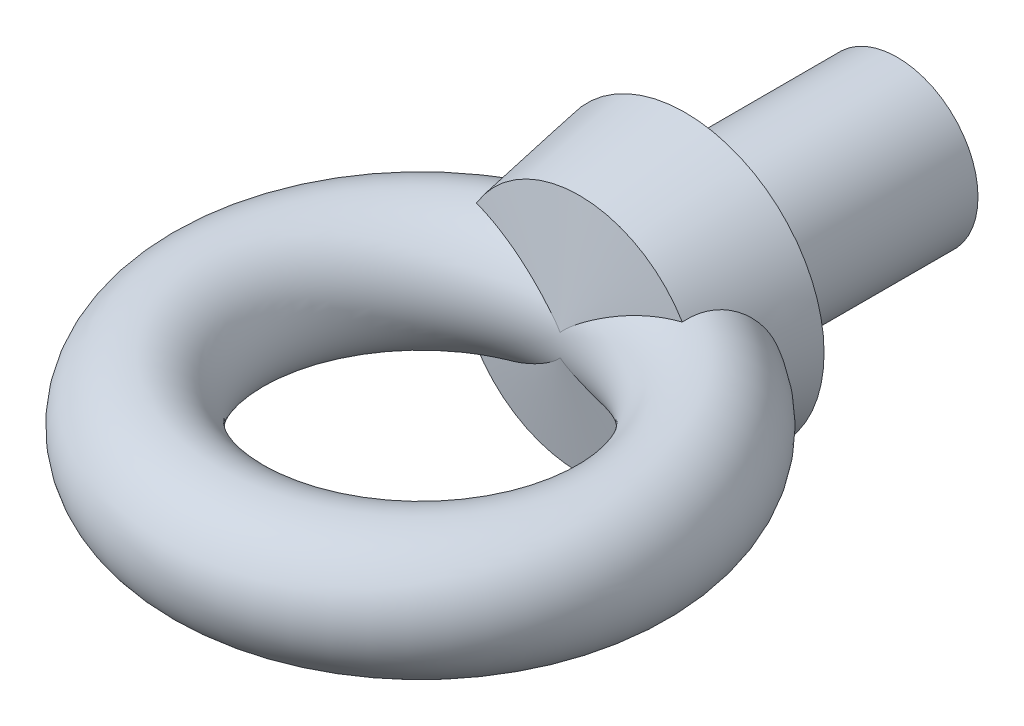
ISO-10303-21;
HEADER;
FILE_DESCRIPTION(('STEP AP214'),'2;1');
FILE_NAME('part.step','',(''),(''),'','','');
FILE_SCHEMA(('AUTOMOTIVE_DESIGN { 1 0 10303 214 1 1 1 1 }'));
ENDSEC;
DATA;
#1=APPLICATION_CONTEXT('core data for automotive mechanical design processes');
#2=APPLICATION_PROTOCOL_DEFINITION('international standard','automotive_design',2000,#1);
#3=PRODUCT_CONTEXT('',#1,'mechanical');
#4=PRODUCT('Part','Part','',(#3));
#5=PRODUCT_RELATED_PRODUCT_CATEGORY('part','',(#4));
#6=PRODUCT_DEFINITION_FORMATION('','',#4);
#7=PRODUCT_DEFINITION_CONTEXT('part definition',#1,'design');
#8=PRODUCT_DEFINITION('design','',#6,#7);
#9=PRODUCT_DEFINITION_SHAPE('','',#8);
#10=(LENGTH_UNIT() NAMED_UNIT(*) SI_UNIT(.MILLI.,.METRE.));
#11=(NAMED_UNIT(*) PLANE_ANGLE_UNIT() SI_UNIT($,.RADIAN.));
#12=(NAMED_UNIT(*) SI_UNIT($,.STERADIAN.) SOLID_ANGLE_UNIT());
#13=UNCERTAINTY_MEASURE_WITH_UNIT(LENGTH_MEASURE(1.E-05),#10,'distance_accuracy_value','');
#14=(GEOMETRIC_REPRESENTATION_CONTEXT(3) GLOBAL_UNCERTAINTY_ASSIGNED_CONTEXT((#13)) GLOBAL_UNIT_ASSIGNED_CONTEXT((#10,
#11,#12)) REPRESENTATION_CONTEXT('',''));
#15=CARTESIAN_POINT('',(0.,0.,0.));
#16=DIRECTION('',(0.,0.,1.));
#17=DIRECTION('',(1.,0.,0.));
#18=AXIS2_PLACEMENT_3D('',#15,#16,#17);
#19=CARTESIAN_POINT('',(0.,0.,-84.));
#20=DIRECTION('',(0.,0.,1.));
#21=DIRECTION('',(1.,0.,0.));
#22=AXIS2_PLACEMENT_3D('',#19,#20,#21);
#23=PLANE('',#22);
#24=CARTESIAN_POINT('',(0.,0.,-84.));
#25=DIRECTION('',(0.,0.,1.));
#26=DIRECTION('',(1.,0.,0.));
#27=AXIS2_PLACEMENT_3D('',#24,#25,#26);
#28=CIRCLE('',#27,32.);
#29=CARTESIAN_POINT('',(32.,0.,-84.));
#30=VERTEX_POINT('',#29);
#31=EDGE_CURVE('E115',#30,#30,#28,.T.);
#32=ORIENTED_EDGE('',*,*,#31,.F.);
#33=EDGE_LOOP('',(#32));
#34=FACE_BOUND('',#33,.T.);
#35=ADVANCED_FACE('F18',(#34),#23,.F.);
#36=CARTESIAN_POINT('',(0.,0.,105.));
#37=DIRECTION('',(0.,-1.,0.));
#38=DIRECTION('',(1.,0.,0.));
#39=AXIS2_PLACEMENT_3D('',#36,#37,#38);
#40=TOROIDAL_SURFACE('',#39,80.,25.);
#41=CARTESIAN_POINT('',(0.,4.33762272129449,49.6208251106195));
#42=CARTESIAN_POINT('',(0.00674186877139267,4.34560276598349,49.6194191798609));
#43=CARTESIAN_POINT('',(0.0134914325699686,4.35357607858774,49.6180116983431));
#44=CARTESIAN_POINT('',(0.256019332210069,4.63951256220023,49.5674394826971));
#45=CARTESIAN_POINT('',(0.501076049297517,4.90933409164479,49.5164059167007));
#46=CARTESIAN_POINT('',(1.00415549372604,5.43613774105319,49.4117979654658));
#47=CARTESIAN_POINT('',(1.26218493499605,5.69311307247473,49.3582222653898));
#48=CARTESIAN_POINT('',(1.78836403169937,6.19729210631446,49.249148231841));
#49=CARTESIAN_POINT('',(2.05653568017863,6.4444718745701,49.1936457444297));
#50=CARTESIAN_POINT('',(2.60015125889973,6.93023349746778,49.0813320552874));
#51=CARTESIAN_POINT('',(2.8755937310769,7.16881705360639,49.0245211162355));
#52=CARTESIAN_POINT('',(3.43274736418994,7.63915119539489,48.9098183566942));
#53=CARTESIAN_POINT('',(3.71446737257554,7.87089090569481,48.8519250319751));
#54=CARTESIAN_POINT('',(4.28276369408501,8.32814833325372,48.7353673083922));
#55=CARTESIAN_POINT('',(4.56934024530698,8.55366574402389,48.6767028717554));
#56=CARTESIAN_POINT('',(5.43533031840708,9.22211221511239,48.4997890676587));
#57=CARTESIAN_POINT('',(6.02089594597971,9.65684524454743,48.3806415181312));
#58=CARTESIAN_POINT('',(7.20520382358196,10.5085547849191,48.1407337448871));
#59=CARTESIAN_POINT('',(7.80395725950894,10.9255152664529,48.0199721892113));
#60=CARTESIAN_POINT('',(9.01212870666324,11.7432202893112,47.777455941877));
#61=CARTESIAN_POINT('',(9.62154554367705,12.1439666001815,47.6557013603453));
#62=CARTESIAN_POINT('',(10.8506668914446,12.9307831515795,47.4113759813224));
#63=CARTESIAN_POINT('',(11.4703828636273,13.3168352147677,47.2888043800679));
#64=CARTESIAN_POINT('',(12.7187050570412,14.0741614649137,47.043218231011));
#65=CARTESIAN_POINT('',(13.3473114385644,14.4454353849633,46.9202036752522));
#66=CARTESIAN_POINT('',(14.6128011741818,15.1730881655671,46.6739377244316));
#67=CARTESIAN_POINT('',(15.2496821528803,15.5294711821994,46.5506864056325));
#68=CARTESIAN_POINT('',(16.5316304099058,16.2271574096204,46.3040430317492));
#69=CARTESIAN_POINT('',(17.1766978031736,16.5684604083767,46.1806509747112));
#70=CARTESIAN_POINT('',(18.7287390623462,17.3659517195687,45.885560325953));
#71=CARTESIAN_POINT('',(19.6394659641863,17.8148602331319,45.713844904671));
#72=CARTESIAN_POINT('',(21.4760740973966,18.6806836076978,45.3705950382512));
#73=CARTESIAN_POINT('',(22.4019556985713,19.0975976865567,45.1990605976387));
#74=CARTESIAN_POINT('',(24.2683268372664,19.8970182234475,44.856430138684));
#75=CARTESIAN_POINT('',(25.2088132126793,20.2795320110329,44.6853340345306));
#76=CARTESIAN_POINT('',(27.1041029962416,21.0075490303576,44.3437652872205));
#77=CARTESIAN_POINT('',(28.0589058226555,21.3530537613036,44.1732926190793));
#78=CARTESIAN_POINT('',(29.9771109576932,22.0023269754944,43.8340927822635));
#79=CARTESIAN_POINT('',(30.9404402447384,22.3063082220155,43.6653611532541));
#80=CARTESIAN_POINT('',(32.8796995592363,22.8714157582036,43.3289826697093));
#81=CARTESIAN_POINT('',(33.8556282443621,23.1325465731265,43.1613357024257));
#82=CARTESIAN_POINT('',(35.8206824334809,23.6088957975224,42.827086401499));
#83=CARTESIAN_POINT('',(36.809827525988,23.8240355226941,42.6604863240435));
#84=CARTESIAN_POINT('',(38.7983678176339,24.2040787413024,42.3288644331201));
#85=CARTESIAN_POINT('',(39.7977668895002,24.3689624735272,42.1638432651375));
#86=CARTESIAN_POINT('',(40.8012437226203,24.5067501987614,41.9998));
#87=B_SPLINE_CURVE_WITH_KNOTS('',3,(#41,#42,#43,#44,#45,#46,#47,#48,#49,#50,#51,#52,#53,#54,#55,
#56,#57,#58,#59,#60,#61,#62,#63,#64,#65,#66,#67,#68,#69,#70,#71,#72,#73,#74,#75,#76,#77,#78,#79,
#80,#81,#82,#83,#84,#85,#86),.UNSPECIFIED.,.F.,.F.,(4,2,2,2,2,2,2,2,2,2,2,2,2,2,2,2,2,2,2,2,2,2,
4),(0.,0.0316227920734179,1.13499958952786,2.23895343010187,3.34545644234681,4.45173922139466,
5.55969447480832,6.66770420516571,8.88415163021425,11.1025575471834,13.3207207000849,
15.5415440856558,17.7624075633324,19.9826469961231,22.2029176366238,25.2916238285942,
28.3804055037936,31.4685274957702,34.556524343099,37.6280520650109,40.6992552066098,
43.7756714230391,46.8532957643607),.UNSPECIFIED.);
#88=CARTESIAN_POINT('',(0.,4.33762272129449,49.6208251106195));
#89=VERTEX_POINT('',#88);
#90=CARTESIAN_POINT('',(40.8000203445718,24.5065822400283,42.));
#91=VERTEX_POINT('',#90);
#92=EDGE_CURVE('E11',#89,#91,#87,.T.);
#93=ORIENTED_EDGE('',*,*,#92,.F.);
#94=CARTESIAN_POINT('',(-40.8012437226203,24.5067501987615,41.9998));
#95=CARTESIAN_POINT('',(-39.9042201163352,24.3835873960502,42.1464425075526));
#96=CARTESIAN_POINT('',(-39.0104337820198,24.2387592439736,42.2938678658373));
#97=CARTESIAN_POINT('',(-37.2308508246666,23.9085852713362,42.5900171572021));
#98=CARTESIAN_POINT('',(-36.3450519496664,23.7232512680486,42.7387406994229));
#99=CARTESIAN_POINT('',(-34.5836154171296,23.3150771860891,43.0371049808653));
#100=CARTESIAN_POINT('',(-33.7079657380726,23.0922876789686,43.1867442246658));
#101=CARTESIAN_POINT('',(-31.9665268059237,22.6115798812845,43.486943073081));
#102=CARTESIAN_POINT('',(-31.1007383386786,22.353658811995,43.6375027495966));
#103=CARTESIAN_POINT('',(-28.5122182130995,21.5285788289196,44.091536094745));
#104=CARTESIAN_POINT('',(-26.8052545774928,20.9117417121013,44.3961907923957));
#105=CARTESIAN_POINT('',(-24.2800242976538,19.900622102623,44.8543916002276));
#106=CARTESIAN_POINT('',(-23.4440085974542,19.5492034038886,45.00735487661));
#107=CARTESIAN_POINT('',(-21.783794020187,18.8194602367342,45.3135688909921));
#108=CARTESIAN_POINT('',(-20.9595950876166,18.4411358947386,45.4668196276379));
#109=CARTESIAN_POINT('',(-19.3981226883491,17.6949481762102,45.7594214147314));
#110=CARTESIAN_POINT('',(-18.6597896676109,17.3292892738862,45.8987626219193));
#111=CARTESIAN_POINT('',(-17.193309720252,16.5780712472155,46.1774115769982));
#112=CARTESIAN_POINT('',(-16.4651627930713,16.1925121239629,46.3167193248911));
#113=CARTESIAN_POINT('',(-15.0189904564526,15.4020399101865,46.5952084152209));
#114=CARTESIAN_POINT('',(-14.3009698005181,14.9971180978894,46.7343896713626));
#115=CARTESIAN_POINT('',(-12.8758112510452,14.1684690948123,47.012364243035));
#116=CARTESIAN_POINT('',(-12.1686730475553,13.7447424409673,47.151157569522));
#117=CARTESIAN_POINT('',(-10.7665314195209,12.8786978762047,47.4279829768752));
#118=CARTESIAN_POINT('',(-10.0715186644631,12.4363952413491,47.5660155815931));
#119=CARTESIAN_POINT('',(-8.69414069893831,11.5319464296133,47.8410765057346));
#120=CARTESIAN_POINT('',(-8.01177715790413,11.0697976597779,47.9781046911731));
#121=CARTESIAN_POINT('',(-6.99988466572398,10.3603518906732,48.1823432466297));
#122=CARTESIAN_POINT('',(-6.66469245643612,10.1212886244293,48.2501722023101));
#123=CARTESIAN_POINT('',(-5.99853705271147,9.63720216031273,48.3853039168226));
#124=CARTESIAN_POINT('',(-5.66757373923451,9.39217913076915,48.4526066904456));
#125=CARTESIAN_POINT('',(-5.01057405596881,8.89559126119626,48.5865218751203));
#126=CARTESIAN_POINT('',(-4.68453651269124,8.64402801940453,48.6531344493743));
#127=CARTESIAN_POINT('',(-4.03821066315793,8.13341433277886,48.7854770644121));
#128=CARTESIAN_POINT('',(-3.71792193910266,7.87436443564376,48.8512071692419));
#129=CARTESIAN_POINT('',(-3.25077266220664,7.48584830533726,48.9472759481029));
#130=CARTESIAN_POINT('',(-3.1011756991568,7.35978083056932,48.9780712852188));
#131=CARTESIAN_POINT('',(-2.80377179348547,7.10548063530101,49.0393524240034));
#132=CARTESIAN_POINT('',(-2.65596484668015,6.97724791986318,49.0698382263955));
#133=CARTESIAN_POINT('',(-2.21547901690188,6.58893594955954,49.1607750867793));
#134=CARTESIAN_POINT('',(-1.92579886727287,6.32529555156119,49.2206924907403));
#135=CARTESIAN_POINT('',(-1.35776084179742,5.7871113538803,49.3383876973751));
#136=CARTESIAN_POINT('',(-1.07937493950083,5.51259837091543,49.3961707597785));
#137=CARTESIAN_POINT('',(-0.537185495001719,4.94902497737521,49.5088864732182));
#138=CARTESIAN_POINT('',(-0.273373266263636,4.65997343307054,49.5638208209873));
#139=CARTESIAN_POINT('',(-0.0134914442053988,4.35357606928125,49.6180116958654));
#140=CARTESIAN_POINT('',(-0.00674188080732916,4.34560275652197,49.6194191772982));
#141=CARTESIAN_POINT('',(0.,4.33762272129449,49.6208251106195));
#142=B_SPLINE_CURVE_WITH_KNOTS('',3,(#94,#95,#96,#97,#98,#99,#100,#101,#102,#103,#104,#105,#106,
#107,#108,#109,#110,#111,#112,#113,#114,#115,#116,#117,#118,#119,#120,#121,#122,#123,#124,#125,
#126,#127,#128,#129,#130,#131,#132,#133,#134,#135,#136,#137,#138,#139,#140,#141),.UNSPECIFIED.,
.F.,.F.,(4,2,2,2,2,2,2,2,2,2,2,2,2,2,2,2,2,2,2,2,2,2,2,4),(0.,2.75125524684759,5.50170890484966,
8.24847835724614,10.9954651912782,16.5110135909998,19.2697417118621,22.0284568708503,
24.5350207629057,27.0415845171462,29.5492881694064,32.0569202651458,34.5625290964908,
37.0684662948905,38.3201954605996,39.5718893131195,40.823280111037,42.0745795919502,
42.6686872793461,43.2627935778564,44.4512572156806,45.6365645379946,46.821157569595,
46.8527803616682),.UNSPECIFIED.);
#143=CARTESIAN_POINT('',(-40.8000203445718,24.5065822400283,42.));
#144=VERTEX_POINT('',#143);
#145=EDGE_CURVE('E55',#144,#89,#142,.T.);
#146=ORIENTED_EDGE('',*,*,#145,.F.);
#147=CARTESIAN_POINT('',(-40.8000008276166,-24.506546244037,42.0002));
#148=CARTESIAN_POINT('',(-40.8326724298356,-24.5668096935044,41.6653619882585));
#149=CARTESIAN_POINT('',(-40.8685179168929,-24.6219324402848,41.3299293831973));
#150=CARTESIAN_POINT('',(-40.9468008122924,-24.721476344183,40.6582034478475));
#151=CARTESIAN_POINT('',(-40.9892390911803,-24.7658960860428,40.3219100096662));
#152=CARTESIAN_POINT('',(-41.1268577118155,-24.8825013236279,39.3119061047211));
#153=CARTESIAN_POINT('',(-41.2322980001884,-24.9379495827838,38.6375290835088));
#154=CARTESIAN_POINT('',(-41.4717081785348,-25.0009284959306,37.2906004771201));
#155=CARTESIAN_POINT('',(-41.6057182580902,-25.0083911821716,36.6180528293322));
#156=CARTESIAN_POINT('',(-41.9020778160944,-24.9723905608259,35.2807429565303));
#157=CARTESIAN_POINT('',(-42.0644182172618,-24.9289435397485,34.6159783103563));
#158=CARTESIAN_POINT('',(-42.4171064131932,-24.788670540927,33.2956391099387));
#159=CARTESIAN_POINT('',(-42.6076030194206,-24.6915529355185,32.6401350100577));
#160=CARTESIAN_POINT('',(-43.013310277706,-24.442566669449,31.3473172698208));
#161=CARTESIAN_POINT('',(-43.228523709188,-24.2906918471854,30.7100056853062));
#162=CARTESIAN_POINT('',(-43.6794568369578,-23.9323850907546,29.4597229373301));
#163=CARTESIAN_POINT('',(-43.9151406626234,-23.7260473486195,28.8467118321733));
#164=CARTESIAN_POINT('',(-44.4026780819729,-23.2595496682111,27.6482735807342));
#165=CARTESIAN_POINT('',(-44.6545306353709,-22.9993931902129,27.0628446640249));
#166=CARTESIAN_POINT('',(-45.1510250913922,-22.4471710678846,25.963503961116));
#167=CARTESIAN_POINT('',(-45.3949186933895,-22.1586598829165,25.4474618619383));
#168=CARTESIAN_POINT('',(-45.8878582666092,-21.5384129157623,24.4447003294692));
#169=CARTESIAN_POINT('',(-46.1369039905181,-21.2066792043238,23.9579794930584));
#170=CARTESIAN_POINT('',(-46.6360287526258,-20.5018271113618,23.0153393168746));
#171=CARTESIAN_POINT('',(-46.8861084804436,-20.1286743756593,22.5594460583707));
#172=CARTESIAN_POINT('',(-47.3828828717789,-19.3435851485026,21.6803810253504));
#173=CARTESIAN_POINT('',(-47.6295773867376,-18.9316469611606,21.2572106831132));
#174=CARTESIAN_POINT('',(-48.1260028009733,-18.0530690526751,20.427334441126));
#175=CARTESIAN_POINT('',(-48.3754089130375,-17.5848396743585,20.0221166672716));
#176=CARTESIAN_POINT('',(-48.8619004869801,-16.6120592538328,19.2496774464411));
#177=CARTESIAN_POINT('',(-49.0989857112794,-16.1075075116805,18.8824567320129));
#178=CARTESIAN_POINT('',(-49.55689570232,-15.0653468198569,18.1869463532043));
#179=CARTESIAN_POINT('',(-49.777721684669,-14.5277403470194,17.8586537772734));
#180=CARTESIAN_POINT('',(-50.1995747247957,-13.4228110322526,17.2417452908765));
#181=CARTESIAN_POINT('',(-50.4006013102113,-12.8554874818457,16.9531303269498));
#182=CARTESIAN_POINT('',(-50.788884929651,-11.6664407500788,16.4032168669786));
#183=CARTESIAN_POINT('',(-50.9749985954845,-11.0434137279061,16.1439265698264));
#184=CARTESIAN_POINT('',(-51.3187566309816,-9.772838653257,15.6704263779893));
#185=CARTESIAN_POINT('',(-51.4764000671775,-9.12528979761276,15.4562179613885));
#186=CARTESIAN_POINT('',(-51.7605418338771,-7.8100910604917,15.0734681895905));
#187=CARTESIAN_POINT('',(-51.8870370255817,-7.14243916083899,14.9049314365411));
#188=CARTESIAN_POINT('',(-52.1067112536818,-5.79177117088671,14.614051115887));
#189=CARTESIAN_POINT('',(-52.1998905588282,-5.10875520457248,14.4917071756559));
#190=CARTESIAN_POINT('',(-52.3516413280656,-3.72956296729462,14.2932085203493));
#191=CARTESIAN_POINT('',(-52.4100801022746,-3.03334658726864,14.2172308702661));
#192=CARTESIAN_POINT('',(-52.4907972975403,-1.63528565640883,14.1124372146221));
#193=CARTESIAN_POINT('',(-52.513075521978,-0.933441074993138,14.083621465499));
#194=CARTESIAN_POINT('',(-52.5210901329009,0.47077739511273,14.0732456197147));
#195=CARTESIAN_POINT('',(-52.5068280003563,1.17315126119772,14.0916836078731));
#196=CARTESIAN_POINT('',(-52.4420087188368,2.57338102698521,14.1757515376171));
#197=CARTESIAN_POINT('',(-52.391451777485,3.27123695250937,14.2413812092446));
#198=CARTESIAN_POINT('',(-52.2554095245558,4.65232553651644,14.418967411422));
#199=CARTESIAN_POINT('',(-52.1701831196959,5.33562790886872,14.5305806206135));
#200=CARTESIAN_POINT('',(-51.9662550069843,6.6880324020025,14.7997587379482));
#201=CARTESIAN_POINT('',(-51.8475534546157,7.35713458872453,14.9573234326592));
#202=CARTESIAN_POINT('',(-51.578675536622,8.67648626679712,15.3179405589016));
#203=CARTESIAN_POINT('',(-51.4284991904787,9.32673576981648,15.5209929622778));
#204=CARTESIAN_POINT('',(-51.0992094196954,10.6039129618648,15.9720155386236));
#205=CARTESIAN_POINT('',(-50.9200957706403,11.2308404699802,16.219986059945));
#206=CARTESIAN_POINT('',(-50.5347708915379,12.4609483651213,16.761876724228));
#207=CARTESIAN_POINT('',(-50.3283964499096,13.0639547644631,17.056075828346));
#208=CARTESIAN_POINT('',(-49.8930278517811,14.2378633326269,17.6885092399798));
#209=CARTESIAN_POINT('',(-49.6640335356161,14.8087652747918,18.0267438583301));
#210=CARTESIAN_POINT('',(-49.1873984852319,15.9147223196876,18.7465036271733));
#211=CARTESIAN_POINT('',(-48.9397504326026,16.4497631958503,19.1280457985666));
#212=CARTESIAN_POINT('',(-48.4304048927748,17.4799746651372,19.9332761536011));
#213=CARTESIAN_POINT('',(-48.1687074503916,17.9751453854283,20.3569642028072));
#214=CARTESIAN_POINT('',(-47.6361492696838,18.9221123186003,21.245313642315));
#215=CARTESIAN_POINT('',(-47.3652869341196,19.3739009177261,21.7099821975242));
#216=CARTESIAN_POINT('',(-46.8197485868805,20.2306215586586,22.6786635897396));
#217=CARTESIAN_POINT('',(-46.5450725499799,20.6355532903657,23.1826766870918));
#218=CARTESIAN_POINT('',(-45.997837824469,21.3949755327048,24.2273976233885));
#219=CARTESIAN_POINT('',(-45.7252770040197,21.7495255342946,24.7680610517357));
#220=CARTESIAN_POINT('',(-45.1876938125501,22.4059875495435,25.8839851167002));
#221=CARTESIAN_POINT('',(-44.922670950601,22.7079029977616,26.4592434925987));
#222=CARTESIAN_POINT('',(-44.4180382049821,23.2439335819268,27.6131238018538));
#223=CARTESIAN_POINT('',(-44.1778192623979,23.4805757672432,28.190306134097));
#224=CARTESIAN_POINT('',(-43.7139926455644,23.9027778586595,29.3695039211972));
#225=CARTESIAN_POINT('',(-43.4903846406501,24.0883387818061,29.9715188813528));
#226=CARTESIAN_POINT('',(-43.0635455959449,24.4080576514182,31.1970544814794));
#227=CARTESIAN_POINT('',(-42.8603431445967,24.5421442035672,31.8206036928775));
#228=CARTESIAN_POINT('',(-42.4779156813408,24.7588881160574,33.0837012983968));
#229=CARTESIAN_POINT('',(-42.2986885843681,24.8415499509382,33.7232482954889));
#230=CARTESIAN_POINT('',(-41.9711046075998,24.9550843402566,34.9950614647775));
#231=CARTESIAN_POINT('',(-41.8220124042252,24.9873682543662,35.6270141127622));
#232=CARTESIAN_POINT('',(-41.5493715890146,25.0065387885577,36.8971783444125));
#233=CARTESIAN_POINT('',(-41.4258292197344,24.9934143279286,37.5353914178767));
#234=CARTESIAN_POINT('',(-41.2044394974785,24.9242819711679,38.812806483563));
#235=CARTESIAN_POINT('',(-41.1065486074752,24.8683473758043,39.4520049235784));
#236=CARTESIAN_POINT('',(-40.9781058077294,24.7545242558738,40.4093049141807));
#237=CARTESIAN_POINT('',(-40.9383658035786,24.7116127679976,40.7280650258698));
#238=CARTESIAN_POINT('',(-40.8648005959117,24.6161889958444,41.3647950595293));
#239=CARTESIAN_POINT('',(-40.8309747280035,24.5636777913541,41.6827650662984));
#240=CARTESIAN_POINT('',(-40.8000008276166,24.506546244037,42.0002));
#241=B_SPLINE_CURVE_WITH_KNOTS('',3,(#147,#148,#149,#150,#151,#152,#153,#154,#155,#156,#157,
#158,#159,#160,#161,#162,#163,#164,#165,#166,#167,#168,#169,#170,#171,#172,#173,#174,#175,#176,
#177,#178,#179,#180,#181,#182,#183,#184,#185,#186,#187,#188,#189,#190,#191,#192,#193,#194,#195,
#196,#197,#198,#199,#200,#201,#202,#203,#204,#205,#206,#207,#208,#209,#210,#211,#212,#213,#214,
#215,#216,#217,#218,#219,#220,#221,#222,#223,#224,#225,#226,#227,#228,#229,#230,#231,#232,#233,
#234,#235,#236,#237,#238,#239,#240),.UNSPECIFIED.,.F.,.F.,(4,2,2,2,2,2,2,2,2,2,2,2,2,2,2,2,2,2,
2,2,2,2,2,2,2,2,2,2,2,2,2,2,2,2,2,2,2,2,2,2,2,2,2,2,2,2,4),(0.,1.0252443930864,2.05062427991001,
4.10278034875918,6.15784249445916,8.21224738528824,10.2779265586616,12.3438382469289,
14.40620014936,16.4684294934436,18.3849165145461,20.3013117524307,22.219308554258,
24.1373892591746,26.1378644114434,28.1383781238162,30.138742117353,32.1391538228018,
34.2367465708495,36.3344080812338,38.4322808859043,40.5301367671763,42.6359546741313,
44.7417840311982,46.8475280409536,48.9532600049789,51.0435471897807,53.1338246659192,
55.2241008482604,57.3143932419326,59.4178213139316,61.5212642342481,63.6255367391234,
65.7298025320956,67.8344369606485,69.9390853169168,72.0412274686909,74.1432323981409,
76.1460497596713,78.1488272414903,80.1543726001875,82.1597434290407,84.107854377317,
86.0564407439882,88.0016981274875,88.9737750917226,89.9457427828784),.UNSPECIFIED.);
#242=CARTESIAN_POINT('',(-40.8000203445718,-24.5065822400283,42.));
#243=VERTEX_POINT('',#242);
#244=EDGE_CURVE('E40',#243,#144,#241,.T.);
#245=ORIENTED_EDGE('',*,*,#244,.F.);
#246=CARTESIAN_POINT('',(0.,-4.33762272129449,49.6208251106195));
#247=CARTESIAN_POINT('',(-0.00674186877139267,-4.34560276598349,49.6194191798609));
#248=CARTESIAN_POINT('',(-0.0134914325699686,-4.35357607858774,49.6180116983431));
#249=CARTESIAN_POINT('',(-0.256019332210069,-4.63951256220023,49.5674394826971));
#250=CARTESIAN_POINT('',(-0.501076049297517,-4.90933409164479,49.5164059167007));
#251=CARTESIAN_POINT('',(-1.00415549372604,-5.43613774105319,49.4117979654658));
#252=CARTESIAN_POINT('',(-1.26218493499605,-5.69311307247473,49.3582222653898));
#253=CARTESIAN_POINT('',(-1.78836403169937,-6.19729210631446,49.249148231841));
#254=CARTESIAN_POINT('',(-2.05653568017863,-6.4444718745701,49.1936457444297));
#255=CARTESIAN_POINT('',(-2.60015125889973,-6.93023349746778,49.0813320552874));
#256=CARTESIAN_POINT('',(-2.8755937310769,-7.16881705360639,49.0245211162355));
#257=CARTESIAN_POINT('',(-3.43274736418994,-7.63915119539489,48.9098183566942));
#258=CARTESIAN_POINT('',(-3.71446737257554,-7.87089090569481,48.8519250319751));
#259=CARTESIAN_POINT('',(-4.28276369408501,-8.32814833325372,48.7353673083922));
#260=CARTESIAN_POINT('',(-4.56934024530698,-8.55366574402389,48.6767028717554));
#261=CARTESIAN_POINT('',(-5.43533031840708,-9.22211221511239,48.4997890676587));
#262=CARTESIAN_POINT('',(-6.02089594597971,-9.65684524454743,48.3806415181312));
#263=CARTESIAN_POINT('',(-7.20520382358196,-10.5085547849191,48.1407337448871));
#264=CARTESIAN_POINT('',(-7.80395725950894,-10.9255152664529,48.0199721892113));
#265=CARTESIAN_POINT('',(-9.01212870666324,-11.7432202893112,47.777455941877));
#266=CARTESIAN_POINT('',(-9.62154554367705,-12.1439666001815,47.6557013603453));
#267=CARTESIAN_POINT('',(-10.8506668914446,-12.9307831515795,47.4113759813224));
#268=CARTESIAN_POINT('',(-11.4703828636273,-13.3168352147677,47.2888043800679));
#269=CARTESIAN_POINT('',(-12.7187050570412,-14.0741614649137,47.043218231011));
#270=CARTESIAN_POINT('',(-13.3473114385644,-14.4454353849633,46.9202036752522));
#271=CARTESIAN_POINT('',(-14.6128011741818,-15.1730881655671,46.6739377244316));
#272=CARTESIAN_POINT('',(-15.2496821528803,-15.5294711821994,46.5506864056325));
#273=CARTESIAN_POINT('',(-16.5316304099058,-16.2271574096204,46.3040430317492));
#274=CARTESIAN_POINT('',(-17.1766978031736,-16.5684604083767,46.1806509747112));
#275=CARTESIAN_POINT('',(-18.7287390623462,-17.3659517195687,45.885560325953));
#276=CARTESIAN_POINT('',(-19.6394659641863,-17.8148602331319,45.713844904671));
#277=CARTESIAN_POINT('',(-21.4760740973966,-18.6806836076978,45.3705950382512));
#278=CARTESIAN_POINT('',(-22.4019556985713,-19.0975976865567,45.1990605976387));
#279=CARTESIAN_POINT('',(-24.2683268372664,-19.8970182234475,44.856430138684));
#280=CARTESIAN_POINT('',(-25.2088132126793,-20.2795320110329,44.6853340345306));
#281=CARTESIAN_POINT('',(-27.1041029962416,-21.0075490303576,44.3437652872205));
#282=CARTESIAN_POINT('',(-28.0589058226555,-21.3530537613036,44.1732926190793));
#283=CARTESIAN_POINT('',(-29.9771109576932,-22.0023269754944,43.8340927822635));
#284=CARTESIAN_POINT('',(-30.9404402447384,-22.3063082220155,43.6653611532541));
#285=CARTESIAN_POINT('',(-32.8796995592363,-22.8714157582036,43.3289826697093));
#286=CARTESIAN_POINT('',(-33.8556282443621,-23.1325465731265,43.1613357024257));
#287=CARTESIAN_POINT('',(-35.8206824334809,-23.6088957975224,42.827086401499));
#288=CARTESIAN_POINT('',(-36.809827525988,-23.8240355226941,42.6604863240435));
#289=CARTESIAN_POINT('',(-38.7983678176339,-24.2040787413024,42.3288644331201));
#290=CARTESIAN_POINT('',(-39.7977668895002,-24.3689624735272,42.1638432651375));
#291=CARTESIAN_POINT('',(-40.8012437226203,-24.5067501987614,41.9998));
#292=B_SPLINE_CURVE_WITH_KNOTS('',3,(#246,#247,#248,#249,#250,#251,#252,#253,#254,#255,#256,
#257,#258,#259,#260,#261,#262,#263,#264,#265,#266,#267,#268,#269,#270,#271,#272,#273,#274,#275,
#276,#277,#278,#279,#280,#281,#282,#283,#284,#285,#286,#287,#288,#289,#290,#291),.UNSPECIFIED.,
.F.,.F.,(4,2,2,2,2,2,2,2,2,2,2,2,2,2,2,2,2,2,2,2,2,2,4),(0.,0.0316227920734179,1.13499958952786,
2.23895343010187,3.34545644234681,4.45173922139466,5.55969447480832,6.66770420516571,
8.88415163021425,11.1025575471834,13.3207207000849,15.5415440856558,17.7624075633324,
19.9826469961231,22.2029176366238,25.2916238285942,28.3804055037936,31.4685274957702,
34.556524343099,37.6280520650109,40.6992552066098,43.7756714230391,46.8532957643607),.UNSPECIFIED.);
#293=CARTESIAN_POINT('',(0.,-4.33762272129451,49.6208251106195));
#294=VERTEX_POINT('',#293);
#295=EDGE_CURVE('E27',#294,#243,#292,.T.);
#296=ORIENTED_EDGE('',*,*,#295,.F.);
#297=CARTESIAN_POINT('',(40.8012437226203,-24.5067501987615,41.9998));
#298=CARTESIAN_POINT('',(39.9042201163352,-24.3835873960502,42.1464425075526));
#299=CARTESIAN_POINT('',(39.0104337820198,-24.2387592439736,42.2938678658373));
#300=CARTESIAN_POINT('',(37.2308508246666,-23.9085852713362,42.5900171572021));
#301=CARTESIAN_POINT('',(36.3450519496664,-23.7232512680486,42.7387406994229));
#302=CARTESIAN_POINT('',(34.5836154171296,-23.3150771860891,43.0371049808653));
#303=CARTESIAN_POINT('',(33.7079657380726,-23.0922876789686,43.1867442246658));
#304=CARTESIAN_POINT('',(31.9665268059237,-22.6115798812845,43.486943073081));
#305=CARTESIAN_POINT('',(31.1007383386786,-22.353658811995,43.6375027495966));
#306=CARTESIAN_POINT('',(28.5122182130995,-21.5285788289196,44.091536094745));
#307=CARTESIAN_POINT('',(26.8052545774928,-20.9117417121013,44.3961907923957));
#308=CARTESIAN_POINT('',(24.2800242976538,-19.900622102623,44.8543916002276));
#309=CARTESIAN_POINT('',(23.4440085974542,-19.5492034038886,45.00735487661));
#310=CARTESIAN_POINT('',(21.783794020187,-18.8194602367342,45.3135688909921));
#311=CARTESIAN_POINT('',(20.9595950876166,-18.4411358947386,45.4668196276379));
#312=CARTESIAN_POINT('',(19.3981226883491,-17.6949481762102,45.7594214147314));
#313=CARTESIAN_POINT('',(18.6597896676109,-17.3292892738862,45.8987626219193));
#314=CARTESIAN_POINT('',(17.193309720252,-16.5780712472155,46.1774115769982));
#315=CARTESIAN_POINT('',(16.4651627930713,-16.1925121239629,46.3167193248911));
#316=CARTESIAN_POINT('',(15.0189904564526,-15.4020399101865,46.5952084152209));
#317=CARTESIAN_POINT('',(14.3009698005181,-14.9971180978894,46.7343896713626));
#318=CARTESIAN_POINT('',(12.8758112510452,-14.1684690948123,47.012364243035));
#319=CARTESIAN_POINT('',(12.1686730475553,-13.7447424409673,47.151157569522));
#320=CARTESIAN_POINT('',(10.7665314195209,-12.8786978762047,47.4279829768752));
#321=CARTESIAN_POINT('',(10.0715186644631,-12.4363952413491,47.5660155815931));
#322=CARTESIAN_POINT('',(8.69414069893831,-11.5319464296133,47.8410765057346));
#323=CARTESIAN_POINT('',(8.01177715790413,-11.0697976597779,47.9781046911731));
#324=CARTESIAN_POINT('',(6.99988466572398,-10.3603518906732,48.1823432466297));
#325=CARTESIAN_POINT('',(6.66469245643612,-10.1212886244293,48.2501722023101));
#326=CARTESIAN_POINT('',(5.99853705271147,-9.63720216031273,48.3853039168226));
#327=CARTESIAN_POINT('',(5.66757373923451,-9.39217913076915,48.4526066904456));
#328=CARTESIAN_POINT('',(5.01057405596881,-8.89559126119626,48.5865218751203));
#329=CARTESIAN_POINT('',(4.68453651269124,-8.64402801940453,48.6531344493743));
#330=CARTESIAN_POINT('',(4.03821066315793,-8.13341433277886,48.7854770644121));
#331=CARTESIAN_POINT('',(3.71792193910266,-7.87436443564376,48.8512071692419));
#332=CARTESIAN_POINT('',(3.25077266220664,-7.48584830533726,48.9472759481029));
#333=CARTESIAN_POINT('',(3.1011756991568,-7.35978083056932,48.9780712852188));
#334=CARTESIAN_POINT('',(2.80377179348547,-7.10548063530101,49.0393524240034));
#335=CARTESIAN_POINT('',(2.65596484668015,-6.97724791986318,49.0698382263955));
#336=CARTESIAN_POINT('',(2.21547901690188,-6.58893594955954,49.1607750867793));
#337=CARTESIAN_POINT('',(1.92579886727287,-6.32529555156119,49.2206924907403));
#338=CARTESIAN_POINT('',(1.35776084179742,-5.7871113538803,49.3383876973751));
#339=CARTESIAN_POINT('',(1.07937493950083,-5.51259837091543,49.3961707597785));
#340=CARTESIAN_POINT('',(0.537185495001719,-4.94902497737521,49.5088864732182));
#341=CARTESIAN_POINT('',(0.273373266263636,-4.65997343307054,49.5638208209873));
#342=CARTESIAN_POINT('',(0.0134914442053988,-4.35357606928125,49.6180116958654));
#343=CARTESIAN_POINT('',(0.00674188080732916,-4.34560275652197,49.6194191772982));
#344=CARTESIAN_POINT('',(0.,-4.33762272129449,49.6208251106195));
#345=B_SPLINE_CURVE_WITH_KNOTS('',3,(#297,#298,#299,#300,#301,#302,#303,#304,#305,#306,#307,
#308,#309,#310,#311,#312,#313,#314,#315,#316,#317,#318,#319,#320,#321,#322,#323,#324,#325,#326,
#327,#328,#329,#330,#331,#332,#333,#334,#335,#336,#337,#338,#339,#340,#341,#342,#343,#344),
.UNSPECIFIED.,.F.,.F.,(4,2,2,2,2,2,2,2,2,2,2,2,2,2,2,2,2,2,2,2,2,2,2,4),(0.,2.75125524684759,
5.50170890484966,8.24847835724614,10.9954651912782,16.5110135909998,19.2697417118621,
22.0284568708503,24.5350207629057,27.0415845171462,29.5492881694064,32.0569202651458,
34.5625290964908,37.0684662948905,38.3201954605996,39.5718893131195,40.823280111037,
42.0745795919502,42.6686872793461,43.2627935778564,44.4512572156806,45.6365645379946,
46.821157569595,46.8527803616682),.UNSPECIFIED.);
#346=CARTESIAN_POINT('',(40.8000203445417,-24.5065822400241,42.000000000005));
#347=VERTEX_POINT('',#346);
#348=EDGE_CURVE('E61',#347,#294,#345,.T.);
#349=ORIENTED_EDGE('',*,*,#348,.F.);
#350=CARTESIAN_POINT('',(40.8000008276166,24.506546244037,42.0002));
#351=CARTESIAN_POINT('',(40.8326724298356,24.5668096935044,41.6653619882585));
#352=CARTESIAN_POINT('',(40.8685179168929,24.6219324402848,41.3299293831973));
#353=CARTESIAN_POINT('',(40.9468008122924,24.721476344183,40.6582034478475));
#354=CARTESIAN_POINT('',(40.9892390911803,24.7658960860428,40.3219100096662));
#355=CARTESIAN_POINT('',(41.1268577118155,24.8825013236279,39.3119061047211));
#356=CARTESIAN_POINT('',(41.2322980001884,24.9379495827838,38.6375290835088));
#357=CARTESIAN_POINT('',(41.4717081785348,25.0009284959306,37.2906004771201));
#358=CARTESIAN_POINT('',(41.6057182580902,25.0083911821716,36.6180528293322));
#359=CARTESIAN_POINT('',(41.9020778160944,24.9723905608259,35.2807429565303));
#360=CARTESIAN_POINT('',(42.0644182172618,24.9289435397485,34.6159783103563));
#361=CARTESIAN_POINT('',(42.4171064131932,24.788670540927,33.2956391099387));
#362=CARTESIAN_POINT('',(42.6076030194206,24.6915529355185,32.6401350100577));
#363=CARTESIAN_POINT('',(43.013310277706,24.442566669449,31.3473172698208));
#364=CARTESIAN_POINT('',(43.228523709188,24.2906918471854,30.7100056853062));
#365=CARTESIAN_POINT('',(43.6794568369578,23.9323850907546,29.4597229373301));
#366=CARTESIAN_POINT('',(43.9151406626234,23.7260473486195,28.8467118321733));
#367=CARTESIAN_POINT('',(44.4026780819729,23.2595496682111,27.6482735807342));
#368=CARTESIAN_POINT('',(44.6545306353709,22.9993931902129,27.0628446640249));
#369=CARTESIAN_POINT('',(45.1510250913922,22.4471710678846,25.963503961116));
#370=CARTESIAN_POINT('',(45.3949186933895,22.1586598829165,25.4474618619383));
#371=CARTESIAN_POINT('',(45.8878582666092,21.5384129157623,24.4447003294692));
#372=CARTESIAN_POINT('',(46.1369039905181,21.2066792043238,23.9579794930584));
#373=CARTESIAN_POINT('',(46.6360287526258,20.5018271113618,23.0153393168745));
#374=CARTESIAN_POINT('',(46.8861084804436,20.1286743756592,22.5594460583707));
#375=CARTESIAN_POINT('',(47.3828828717789,19.3435851485026,21.6803810253504));
#376=CARTESIAN_POINT('',(47.6295773867376,18.9316469611606,21.2572106831131));
#377=CARTESIAN_POINT('',(48.1260028009733,18.0530690526751,20.427334441126));
#378=CARTESIAN_POINT('',(48.3754089130375,17.5848396743584,20.0221166672715));
#379=CARTESIAN_POINT('',(48.8619004869801,16.6120592538328,19.2496774464411));
#380=CARTESIAN_POINT('',(49.0989857112794,16.1075075116805,18.8824567320129));
#381=CARTESIAN_POINT('',(49.55689570232,15.0653468198569,18.1869463532043));
#382=CARTESIAN_POINT('',(49.777721684669,14.5277403470194,17.8586537772734));
#383=CARTESIAN_POINT('',(50.1995747247957,13.4228110322525,17.2417452908765));
#384=CARTESIAN_POINT('',(50.4006013102113,12.8554874818457,16.9531303269498));
#385=CARTESIAN_POINT('',(50.788884929651,11.6664407500788,16.4032168669786));
#386=CARTESIAN_POINT('',(50.9749985954845,11.0434137279061,16.1439265698264));
#387=CARTESIAN_POINT('',(51.3187566309816,9.77283865325698,15.6704263779893));
#388=CARTESIAN_POINT('',(51.4764000671775,9.12528979761274,15.4562179613885));
#389=CARTESIAN_POINT('',(51.7605418338771,7.81009106049168,15.0734681895905));
#390=CARTESIAN_POINT('',(51.8870370255817,7.14243916083897,14.9049314365411));
#391=CARTESIAN_POINT('',(52.1067112536818,5.79177117088669,14.614051115887));
#392=CARTESIAN_POINT('',(52.1998905588282,5.10875520457246,14.4917071756559));
#393=CARTESIAN_POINT('',(52.3516413280656,3.7295629672946,14.2932085203493));
#394=CARTESIAN_POINT('',(52.4100801022746,3.03334658726862,14.2172308702661));
#395=CARTESIAN_POINT('',(52.4907972975403,1.63528565640881,14.1124372146221));
#396=CARTESIAN_POINT('',(52.513075521978,0.933441074993119,14.083621465499));
#397=CARTESIAN_POINT('',(52.5210901329009,-0.470777395112749,14.0732456197147));
#398=CARTESIAN_POINT('',(52.5068280003563,-1.17315126119774,14.0916836078731));
#399=CARTESIAN_POINT('',(52.4420087188368,-2.57338102698523,14.1757515376171));
#400=CARTESIAN_POINT('',(52.391451777485,-3.27123695250939,14.2413812092446));
#401=CARTESIAN_POINT('',(52.2554095245558,-4.65232553651646,14.418967411422));
#402=CARTESIAN_POINT('',(52.1701831196959,-5.33562790886874,14.5305806206135));
#403=CARTESIAN_POINT('',(51.9662550069843,-6.68803240200252,14.7997587379482));
#404=CARTESIAN_POINT('',(51.8475534546157,-7.35713458872455,14.9573234326592));
#405=CARTESIAN_POINT('',(51.578675536622,-8.67648626679714,15.3179405589016));
#406=CARTESIAN_POINT('',(51.4284991904787,-9.3267357698165,15.5209929622778));
#407=CARTESIAN_POINT('',(51.0992094196954,-10.6039129618648,15.9720155386236));
#408=CARTESIAN_POINT('',(50.9200957706403,-11.2308404699802,16.219986059945));
#409=CARTESIAN_POINT('',(50.5347708915379,-12.4609483651213,16.761876724228));
#410=CARTESIAN_POINT('',(50.3283964499096,-13.0639547644631,17.056075828346));
#411=CARTESIAN_POINT('',(49.8930278517811,-14.2378633326269,17.6885092399799));
#412=CARTESIAN_POINT('',(49.6640335356161,-14.8087652747918,18.0267438583301));
#413=CARTESIAN_POINT('',(49.1873984852319,-15.9147223196876,18.7465036271733));
#414=CARTESIAN_POINT('',(48.9397504326026,-16.4497631958503,19.1280457985666));
#415=CARTESIAN_POINT('',(48.4304048927748,-17.4799746651372,19.9332761536011));
#416=CARTESIAN_POINT('',(48.1687074503916,-17.9751453854283,20.3569642028072));
#417=CARTESIAN_POINT('',(47.6361492696838,-18.9221123186003,21.245313642315));
#418=CARTESIAN_POINT('',(47.3652869341196,-19.3739009177261,21.7099821975242));
#419=CARTESIAN_POINT('',(46.8197485868805,-20.2306215586586,22.6786635897396));
#420=CARTESIAN_POINT('',(46.5450725499799,-20.6355532903657,23.1826766870918));
#421=CARTESIAN_POINT('',(45.997837824469,-21.3949755327048,24.2273976233885));
#422=CARTESIAN_POINT('',(45.7252770040197,-21.7495255342947,24.7680610517357));
#423=CARTESIAN_POINT('',(45.1876938125501,-22.4059875495436,25.8839851167002));
#424=CARTESIAN_POINT('',(44.922670950601,-22.7079029977616,26.4592434925987));
#425=CARTESIAN_POINT('',(44.4180382049821,-23.2439335819268,27.6131238018538));
#426=CARTESIAN_POINT('',(44.1778192623979,-23.4805757672432,28.1903061340971));
#427=CARTESIAN_POINT('',(43.7139926455644,-23.9027778586595,29.3695039211972));
#428=CARTESIAN_POINT('',(43.4903846406501,-24.0883387818061,29.9715188813529));
#429=CARTESIAN_POINT('',(43.0635455959449,-24.4080576514182,31.1970544814795));
#430=CARTESIAN_POINT('',(42.8603431445967,-24.5421442035672,31.8206036928775));
#431=CARTESIAN_POINT('',(42.4779156813408,-24.7588881160574,33.0837012983968));
#432=CARTESIAN_POINT('',(42.2986885843681,-24.8415499509382,33.7232482954889));
#433=CARTESIAN_POINT('',(41.9711046075998,-24.9550843402566,34.9950614647775));
#434=CARTESIAN_POINT('',(41.8220124042252,-24.9873682543662,35.6270141127622));
#435=CARTESIAN_POINT('',(41.5493715890146,-25.0065387885577,36.8971783444125));
#436=CARTESIAN_POINT('',(41.4258292197344,-24.9934143279286,37.5353914178767));
#437=CARTESIAN_POINT('',(41.2044394974785,-24.9242819711679,38.812806483563));
#438=CARTESIAN_POINT('',(41.1065486074752,-24.8683473758043,39.4520049235784));
#439=CARTESIAN_POINT('',(40.9781058077294,-24.7545242558738,40.4093049141807));
#440=CARTESIAN_POINT('',(40.9383658035786,-24.7116127679976,40.7280650258699));
#441=CARTESIAN_POINT('',(40.8648005959117,-24.6161889958444,41.3647950595293));
#442=CARTESIAN_POINT('',(40.8309747280035,-24.5636777913541,41.6827650662984));
#443=CARTESIAN_POINT('',(40.8000008276166,-24.506546244037,42.0002));
#444=B_SPLINE_CURVE_WITH_KNOTS('',3,(#350,#351,#352,#353,#354,#355,#356,#357,#358,#359,#360,
#361,#362,#363,#364,#365,#366,#367,#368,#369,#370,#371,#372,#373,#374,#375,#376,#377,#378,#379,
#380,#381,#382,#383,#384,#385,#386,#387,#388,#389,#390,#391,#392,#393,#394,#395,#396,#397,#398,
#399,#400,#401,#402,#403,#404,#405,#406,#407,#408,#409,#410,#411,#412,#413,#414,#415,#416,#417,
#418,#419,#420,#421,#422,#423,#424,#425,#426,#427,#428,#429,#430,#431,#432,#433,#434,#435,#436,
#437,#438,#439,#440,#441,#442,#443),.UNSPECIFIED.,.F.,.F.,(4,2,2,2,2,2,2,2,2,2,2,2,2,2,2,2,2,2,
2,2,2,2,2,2,2,2,2,2,2,2,2,2,2,2,2,2,2,2,2,2,2,2,2,2,2,2,4),(0.,1.0252443930864,2.05062427991001,
4.10278034875918,6.15784249445916,8.21224738528824,10.2779265586616,12.3438382469289,
14.4062001493599,16.4684294934436,18.3849165145461,20.3013117524307,22.2193085542581,
24.1373892591747,26.1378644114434,28.1383781238162,30.138742117353,32.1391538228018,
34.2367465708495,36.3344080812338,38.4322808859043,40.5301367671763,42.6359546741313,
44.7417840311982,46.8475280409536,48.953260004979,51.0435471897807,53.1338246659192,
55.2241008482604,57.3143932419326,59.4178213139316,61.5212642342481,63.6255367391234,
65.7298025320956,67.8344369606485,69.9390853169169,72.041227468691,74.143232398141,
76.1460497596713,78.1488272414903,80.1543726001876,82.1597434290407,84.107854377317,
86.0564407439882,88.0016981274875,88.9737750917226,89.9457427828784),.UNSPECIFIED.);
#445=EDGE_CURVE('E34',#91,#347,#444,.T.);
#446=ORIENTED_EDGE('',*,*,#445,.F.);
#447=EDGE_LOOP('',(#93,#146,#245,#296,#349,#446));
#448=FACE_BOUND('',#447,.T.);
#449=ADVANCED_FACE('F60',(#448),#40,.T.);
#450=CARTESIAN_POINT('',(0.,0.,49.6208251106195));
#451=DIRECTION('',(0.,0.,-1.));
#452=DIRECTION('',(-1.,0.,0.));
#453=AXIS2_PLACEMENT_3D('',#450,#451,#452);
#454=CONICAL_SURFACE('',#453,4.33762272129449,1.39640887869768);
#455=ORIENTED_EDGE('',*,*,#348,.T.);
#456=ORIENTED_EDGE('',*,*,#295,.T.);
#457=CARTESIAN_POINT('',(0.,0.,42.));
#458=DIRECTION('',(0.,0.,1.));
#459=DIRECTION('',(1.,0.,0.));
#460=AXIS2_PLACEMENT_3D('',#457,#458,#459);
#461=CIRCLE('',#460,47.5942668102445);
#462=EDGE_CURVE('E57',#243,#347,#461,.T.);
#463=ORIENTED_EDGE('',*,*,#462,.T.);
#464=EDGE_LOOP('',(#455,#456,#463));
#465=FACE_BOUND('',#464,.T.);
#466=ADVANCED_FACE('F92',(#465),#454,.T.);
#467=EDGE_CURVE('E53',#91,#144,#461,.T.);
#468=ORIENTED_EDGE('',*,*,#467,.T.);
#469=ORIENTED_EDGE('',*,*,#145,.T.);
#470=ORIENTED_EDGE('',*,*,#92,.T.);
#471=EDGE_LOOP('',(#468,#469,#470));
#472=FACE_BOUND('',#471,.T.);
#473=ADVANCED_FACE('F54',(#472),#454,.T.);
#474=CARTESIAN_POINT('',(0.,0.,42.));
#475=DIRECTION('',(0.,0.,-1.));
#476=DIRECTION('',(-1.,0.,0.));
#477=AXIS2_PLACEMENT_3D('',#474,#475,#476);
#478=CONICAL_SURFACE('',#477,47.5942668102445,0.174532925199433);
#479=CARTESIAN_POINT('',(0.,0.,0.));
#480=DIRECTION('',(0.,0.,1.));
#481=DIRECTION('',(1.,0.,0.));
#482=AXIS2_PLACEMENT_3D('',#479,#480,#481);
#483=CIRCLE('',#482,55.);
#484=CARTESIAN_POINT('',(55.,0.,0.));
#485=VERTEX_POINT('',#484);
#486=EDGE_CURVE('E58',#485,#485,#483,.T.);
#487=ORIENTED_EDGE('',*,*,#486,.T.);
#488=EDGE_LOOP('',(#487));
#489=FACE_BOUND('',#488,.T.);
#490=ORIENTED_EDGE('',*,*,#467,.F.);
#491=ORIENTED_EDGE('',*,*,#445,.T.);
#492=ORIENTED_EDGE('',*,*,#462,.F.);
#493=ORIENTED_EDGE('',*,*,#244,.T.);
#494=EDGE_LOOP('',(#490,#491,#492,#493));
#495=FACE_BOUND('',#494,.T.);
#496=ADVANCED_FACE('F64',(#489,#495),#478,.T.);
#497=CARTESIAN_POINT('',(0.,55.,0.));
#498=DIRECTION('',(0.,0.,-1.));
#499=DIRECTION('',(-1.,0.,0.));
#500=AXIS2_PLACEMENT_3D('',#497,#498,#499);
#501=PLANE('',#500);
#502=CARTESIAN_POINT('',(0.,0.,0.));
#503=DIRECTION('',(0.,0.,-1.));
#504=DIRECTION('',(-1.,0.,0.));
#505=AXIS2_PLACEMENT_3D('',#502,#503,#504);
#506=CIRCLE('',#505,32.);
#507=CARTESIAN_POINT('',(-32.,0.,0.));
#508=VERTEX_POINT('',#507);
#509=EDGE_CURVE('E22',#508,#508,#506,.F.);
#510=ORIENTED_EDGE('',*,*,#509,.T.);
#511=EDGE_LOOP('',(#510));
#512=FACE_BOUND('',#511,.T.);
#513=ORIENTED_EDGE('',*,*,#486,.F.);
#514=EDGE_LOOP('',(#513));
#515=FACE_BOUND('',#514,.T.);
#516=ADVANCED_FACE('F20',(#512,#515),#501,.T.);
#517=CARTESIAN_POINT('',(0.,0.,-57.));
#518=DIRECTION('',(0.,0.,1.));
#519=DIRECTION('',(1.,0.,0.));
#520=AXIS2_PLACEMENT_3D('',#517,#518,#519);
#521=CYLINDRICAL_SURFACE('',#520,32.);
#522=ORIENTED_EDGE('',*,*,#31,.T.);
#523=EDGE_LOOP('',(#522));
#524=FACE_BOUND('',#523,.T.);
#525=ORIENTED_EDGE('',*,*,#509,.F.);
#526=EDGE_LOOP('',(#525));
#527=FACE_BOUND('',#526,.T.);
#528=ADVANCED_FACE('F91',(#524,#527),#521,.T.);
#529=CLOSED_SHELL('',(#35,#449,#466,#473,#496,#516,#528));
#530=MANIFOLD_SOLID_BREP('B1',#529);
#531=ADVANCED_BREP_SHAPE_REPRESENTATION('',(#18,#530),#14);
#532=SHAPE_DEFINITION_REPRESENTATION(#9,#531);
ENDSEC;
END-ISO-10303-21;
